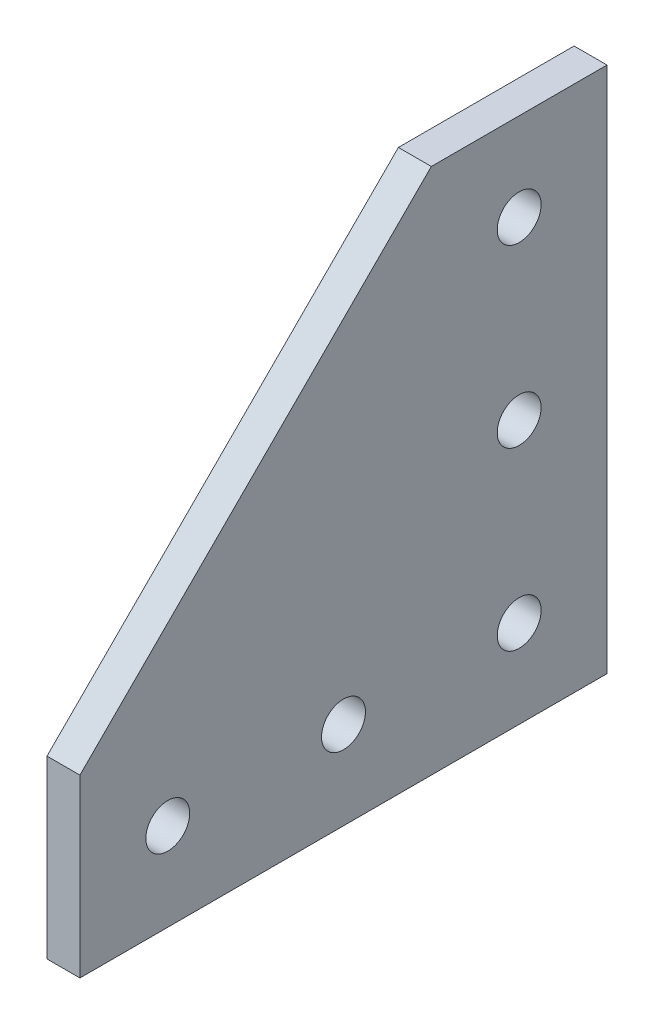
ISO-10303-21;
HEADER;
FILE_DESCRIPTION(('STEP AP214'),'2;1');
FILE_NAME('part.step','',(''),(''),'','','');
FILE_SCHEMA(('AUTOMOTIVE_DESIGN { 1 0 10303 214 1 1 1 1 }'));
ENDSEC;
DATA;
#1=APPLICATION_CONTEXT('core data for automotive mechanical design processes');
#2=APPLICATION_PROTOCOL_DEFINITION('international standard','automotive_design',2000,#1);
#3=PRODUCT_CONTEXT('',#1,'mechanical');
#4=PRODUCT('Part','Part','',(#3));
#5=PRODUCT_RELATED_PRODUCT_CATEGORY('part','',(#4));
#6=PRODUCT_DEFINITION_FORMATION('','',#4);
#7=PRODUCT_DEFINITION_CONTEXT('part definition',#1,'design');
#8=PRODUCT_DEFINITION('design','',#6,#7);
#9=PRODUCT_DEFINITION_SHAPE('','',#8);
#10=(LENGTH_UNIT() NAMED_UNIT(*) SI_UNIT(.MILLI.,.METRE.));
#11=(NAMED_UNIT(*) PLANE_ANGLE_UNIT() SI_UNIT($,.RADIAN.));
#12=(NAMED_UNIT(*) SI_UNIT($,.STERADIAN.) SOLID_ANGLE_UNIT());
#13=UNCERTAINTY_MEASURE_WITH_UNIT(LENGTH_MEASURE(1.E-05),#10,'distance_accuracy_value','');
#14=(GEOMETRIC_REPRESENTATION_CONTEXT(3) GLOBAL_UNCERTAINTY_ASSIGNED_CONTEXT((#13)) GLOBAL_UNIT_ASSIGNED_CONTEXT((#10,
#11,#12)) REPRESENTATION_CONTEXT('',''));
#15=CARTESIAN_POINT('',(0.,0.,0.));
#16=DIRECTION('',(0.,0.,1.));
#17=DIRECTION('',(1.,0.,0.));
#18=AXIS2_PLACEMENT_3D('',#15,#16,#17);
#19=CARTESIAN_POINT('',(4.7625,0.,0.));
#20=DIRECTION('',(-1.,0.,0.));
#21=DIRECTION('',(0.,0.,1.));
#22=AXIS2_PLACEMENT_3D('',#19,#20,#21);
#23=PLANE('',#22);
#24=DIRECTION('',(0.,1.,0.));
#25=VECTOR('',#24,1.);
#26=CARTESIAN_POINT('',(4.7625,76.2,0.));
#27=LINE('',#26,#25);
#28=CARTESIAN_POINT('',(4.7625,0.,0.));
#29=VERTEX_POINT('',#28);
#30=CARTESIAN_POINT('',(4.7625,76.2,0.));
#31=VERTEX_POINT('',#30);
#32=EDGE_CURVE('E117',#29,#31,#27,.T.);
#33=ORIENTED_EDGE('',*,*,#32,.T.);
#34=DIRECTION('',(0.,0.,1.));
#35=VECTOR('',#34,1.);
#36=CARTESIAN_POINT('',(4.7625,76.2,25.4));
#37=LINE('',#36,#35);
#38=CARTESIAN_POINT('',(4.7625,76.2,25.4));
#39=VERTEX_POINT('',#38);
#40=EDGE_CURVE('E84',#31,#39,#37,.T.);
#41=ORIENTED_EDGE('',*,*,#40,.T.);
#42=DIRECTION('',(0.,-0.707106781186547,0.707106781186547));
#43=VECTOR('',#42,1.);
#44=CARTESIAN_POINT('',(4.7625,25.4,76.2));
#45=LINE('',#44,#43);
#46=CARTESIAN_POINT('',(4.7625,25.4,76.2));
#47=VERTEX_POINT('',#46);
#48=EDGE_CURVE('E88',#39,#47,#45,.T.);
#49=ORIENTED_EDGE('',*,*,#48,.T.);
#50=DIRECTION('',(0.,-1.,0.));
#51=VECTOR('',#50,1.);
#52=CARTESIAN_POINT('',(4.7625,0.,76.2));
#53=LINE('',#52,#51);
#54=CARTESIAN_POINT('',(4.7625,0.,76.2));
#55=VERTEX_POINT('',#54);
#56=EDGE_CURVE('E92',#47,#55,#53,.T.);
#57=ORIENTED_EDGE('',*,*,#56,.T.);
#58=DIRECTION('',(0.,0.,-1.));
#59=VECTOR('',#58,1.);
#60=CARTESIAN_POINT('',(4.7625,0.,0.));
#61=LINE('',#60,#59);
#62=EDGE_CURVE('E50',#55,#29,#61,.T.);
#63=ORIENTED_EDGE('',*,*,#62,.T.);
#64=EDGE_LOOP('',(#33,#41,#49,#57,#63));
#65=FACE_BOUND('',#64,.T.);
#66=CARTESIAN_POINT('',(4.7625,12.7,12.7));
#67=DIRECTION('',(1.,0.,0.));
#68=DIRECTION('',(0.,0.,-1.));
#69=AXIS2_PLACEMENT_3D('',#66,#67,#68);
#70=CIRCLE('',#69,3.175);
#71=CARTESIAN_POINT('',(4.7625,12.7,9.52500000000001));
#72=VERTEX_POINT('',#71);
#73=EDGE_CURVE('E112',#72,#72,#70,.T.);
#74=ORIENTED_EDGE('',*,*,#73,.F.);
#75=EDGE_LOOP('',(#74));
#76=FACE_BOUND('',#75,.T.);
#77=CARTESIAN_POINT('',(4.7625,38.1,12.7));
#78=DIRECTION('',(1.,0.,0.));
#79=DIRECTION('',(0.,0.,-1.));
#80=AXIS2_PLACEMENT_3D('',#77,#78,#79);
#81=CIRCLE('',#80,3.175);
#82=CARTESIAN_POINT('',(4.7625,38.1,9.525));
#83=VERTEX_POINT('',#82);
#84=EDGE_CURVE('E186',#83,#83,#81,.T.);
#85=ORIENTED_EDGE('',*,*,#84,.F.);
#86=EDGE_LOOP('',(#85));
#87=FACE_BOUND('',#86,.T.);
#88=CARTESIAN_POINT('',(4.7625,63.5,12.7));
#89=DIRECTION('',(1.,0.,0.));
#90=DIRECTION('',(0.,0.,-1.));
#91=AXIS2_PLACEMENT_3D('',#88,#89,#90);
#92=CIRCLE('',#91,3.175);
#93=CARTESIAN_POINT('',(4.7625,63.5,9.525));
#94=VERTEX_POINT('',#93);
#95=EDGE_CURVE('E180',#94,#94,#92,.T.);
#96=ORIENTED_EDGE('',*,*,#95,.F.);
#97=EDGE_LOOP('',(#96));
#98=FACE_BOUND('',#97,.T.);
#99=CARTESIAN_POINT('',(4.7625,12.7,38.1));
#100=DIRECTION('',(1.,0.,0.));
#101=DIRECTION('',(0.,0.,-1.));
#102=AXIS2_PLACEMENT_3D('',#99,#100,#101);
#103=CIRCLE('',#102,3.175);
#104=CARTESIAN_POINT('',(4.7625,12.7,34.925));
#105=VERTEX_POINT('',#104);
#106=EDGE_CURVE('E174',#105,#105,#103,.T.);
#107=ORIENTED_EDGE('',*,*,#106,.F.);
#108=EDGE_LOOP('',(#107));
#109=FACE_BOUND('',#108,.T.);
#110=CARTESIAN_POINT('',(4.7625,12.7,63.5));
#111=DIRECTION('',(1.,0.,0.));
#112=DIRECTION('',(0.,0.,-1.));
#113=AXIS2_PLACEMENT_3D('',#110,#111,#112);
#114=CIRCLE('',#113,3.175);
#115=CARTESIAN_POINT('',(4.7625,12.7,60.325));
#116=VERTEX_POINT('',#115);
#117=EDGE_CURVE('E165',#116,#116,#114,.T.);
#118=ORIENTED_EDGE('',*,*,#117,.F.);
#119=EDGE_LOOP('',(#118));
#120=FACE_BOUND('',#119,.T.);
#121=ADVANCED_FACE('F33',(#65,#76,#87,#98,#109,#120),#23,.F.);
#122=CARTESIAN_POINT('',(0.,0.,0.));
#123=DIRECTION('',(-1.,0.,0.));
#124=DIRECTION('',(0.,0.,1.));
#125=AXIS2_PLACEMENT_3D('',#122,#123,#124);
#126=PLANE('',#125);
#127=CARTESIAN_POINT('',(0.,12.7,38.1));
#128=DIRECTION('',(1.,0.,0.));
#129=DIRECTION('',(0.,0.,-1.));
#130=AXIS2_PLACEMENT_3D('',#127,#128,#129);
#131=CIRCLE('',#130,3.175);
#132=CARTESIAN_POINT('',(0.,12.7,34.925));
#133=VERTEX_POINT('',#132);
#134=EDGE_CURVE('E171',#133,#133,#131,.T.);
#135=ORIENTED_EDGE('',*,*,#134,.T.);
#136=EDGE_LOOP('',(#135));
#137=FACE_BOUND('',#136,.T.);
#138=CARTESIAN_POINT('',(0.,38.1,12.7));
#139=DIRECTION('',(1.,0.,0.));
#140=DIRECTION('',(0.,0.,-1.));
#141=AXIS2_PLACEMENT_3D('',#138,#139,#140);
#142=CIRCLE('',#141,3.175);
#143=CARTESIAN_POINT('',(0.,38.1,9.525));
#144=VERTEX_POINT('',#143);
#145=EDGE_CURVE('E183',#144,#144,#142,.T.);
#146=ORIENTED_EDGE('',*,*,#145,.T.);
#147=EDGE_LOOP('',(#146));
#148=FACE_BOUND('',#147,.T.);
#149=DIRECTION('',(0.,1.,0.));
#150=VECTOR('',#149,1.);
#151=CARTESIAN_POINT('',(0.,76.2,0.));
#152=LINE('',#151,#150);
#153=CARTESIAN_POINT('',(0.,0.,0.));
#154=VERTEX_POINT('',#153);
#155=CARTESIAN_POINT('',(0.,76.2,0.));
#156=VERTEX_POINT('',#155);
#157=EDGE_CURVE('E108',#154,#156,#152,.T.);
#158=ORIENTED_EDGE('',*,*,#157,.F.);
#159=DIRECTION('',(0.,0.,-1.));
#160=VECTOR('',#159,1.);
#161=CARTESIAN_POINT('',(0.,0.,0.));
#162=LINE('',#161,#160);
#163=CARTESIAN_POINT('',(0.,0.,76.2));
#164=VERTEX_POINT('',#163);
#165=EDGE_CURVE('E76',#164,#154,#162,.T.);
#166=ORIENTED_EDGE('',*,*,#165,.F.);
#167=DIRECTION('',(0.,-1.,0.));
#168=VECTOR('',#167,1.);
#169=CARTESIAN_POINT('',(0.,0.,76.2));
#170=LINE('',#169,#168);
#171=CARTESIAN_POINT('',(0.,25.4,76.2));
#172=VERTEX_POINT('',#171);
#173=EDGE_CURVE('E70',#172,#164,#170,.T.);
#174=ORIENTED_EDGE('',*,*,#173,.F.);
#175=DIRECTION('',(0.,-0.707106781186547,0.707106781186547));
#176=VECTOR('',#175,1.);
#177=CARTESIAN_POINT('',(0.,25.4,76.2));
#178=LINE('',#177,#176);
#179=CARTESIAN_POINT('',(0.,76.2,25.4));
#180=VERTEX_POINT('',#179);
#181=EDGE_CURVE('E99',#180,#172,#178,.T.);
#182=ORIENTED_EDGE('',*,*,#181,.F.);
#183=DIRECTION('',(0.,0.,1.));
#184=VECTOR('',#183,1.);
#185=CARTESIAN_POINT('',(0.,76.2,25.4));
#186=LINE('',#185,#184);
#187=EDGE_CURVE('E111',#156,#180,#186,.T.);
#188=ORIENTED_EDGE('',*,*,#187,.F.);
#189=EDGE_LOOP('',(#158,#166,#174,#182,#188));
#190=FACE_BOUND('',#189,.T.);
#191=CARTESIAN_POINT('',(0.,12.7,12.7));
#192=DIRECTION('',(1.,0.,0.));
#193=DIRECTION('',(0.,0.,-1.));
#194=AXIS2_PLACEMENT_3D('',#191,#192,#193);
#195=CIRCLE('',#194,3.175);
#196=CARTESIAN_POINT('',(0.,12.7,9.52500000000001));
#197=VERTEX_POINT('',#196);
#198=EDGE_CURVE('E189',#197,#197,#195,.T.);
#199=ORIENTED_EDGE('',*,*,#198,.T.);
#200=EDGE_LOOP('',(#199));
#201=FACE_BOUND('',#200,.T.);
#202=CARTESIAN_POINT('',(0.,63.5,12.7));
#203=DIRECTION('',(1.,0.,0.));
#204=DIRECTION('',(0.,0.,-1.));
#205=AXIS2_PLACEMENT_3D('',#202,#203,#204);
#206=CIRCLE('',#205,3.175);
#207=CARTESIAN_POINT('',(0.,63.5,9.525));
#208=VERTEX_POINT('',#207);
#209=EDGE_CURVE('E177',#208,#208,#206,.T.);
#210=ORIENTED_EDGE('',*,*,#209,.T.);
#211=EDGE_LOOP('',(#210));
#212=FACE_BOUND('',#211,.T.);
#213=CARTESIAN_POINT('',(0.,12.7,63.5));
#214=DIRECTION('',(1.,0.,0.));
#215=DIRECTION('',(0.,0.,-1.));
#216=AXIS2_PLACEMENT_3D('',#213,#214,#215);
#217=CIRCLE('',#216,3.175);
#218=CARTESIAN_POINT('',(0.,12.7,60.325));
#219=VERTEX_POINT('',#218);
#220=EDGE_CURVE('E168',#219,#219,#217,.T.);
#221=ORIENTED_EDGE('',*,*,#220,.T.);
#222=EDGE_LOOP('',(#221));
#223=FACE_BOUND('',#222,.T.);
#224=ADVANCED_FACE('F121',(#137,#148,#190,#201,#212,#223),#126,.T.);
#225=CARTESIAN_POINT('',(4.7625,76.2,0.));
#226=DIRECTION('',(0.,0.,1.));
#227=DIRECTION('',(0.,-1.,0.));
#228=AXIS2_PLACEMENT_3D('',#225,#226,#227);
#229=PLANE('',#228);
#230=ORIENTED_EDGE('',*,*,#157,.T.);
#231=DIRECTION('',(-1.,0.,0.));
#232=VECTOR('',#231,1.);
#233=CARTESIAN_POINT('',(4.7625,76.2,0.));
#234=LINE('',#233,#232);
#235=EDGE_CURVE('E11',#31,#156,#234,.T.);
#236=ORIENTED_EDGE('',*,*,#235,.F.);
#237=ORIENTED_EDGE('',*,*,#32,.F.);
#238=DIRECTION('',(-1.,0.,0.));
#239=VECTOR('',#238,1.);
#240=CARTESIAN_POINT('',(4.7625,0.,0.));
#241=LINE('',#240,#239);
#242=EDGE_CURVE('E104',#29,#154,#241,.T.);
#243=ORIENTED_EDGE('',*,*,#242,.T.);
#244=EDGE_LOOP('',(#230,#236,#237,#243));
#245=FACE_BOUND('',#244,.T.);
#246=ADVANCED_FACE('F35',(#245),#229,.F.);
#247=CARTESIAN_POINT('',(4.7625,76.2,25.4));
#248=DIRECTION('',(0.,-1.,0.));
#249=DIRECTION('',(0.,0.,-1.));
#250=AXIS2_PLACEMENT_3D('',#247,#248,#249);
#251=PLANE('',#250);
#252=ORIENTED_EDGE('',*,*,#187,.T.);
#253=DIRECTION('',(-1.,0.,0.));
#254=VECTOR('',#253,1.);
#255=CARTESIAN_POINT('',(4.7625,76.2,25.4));
#256=LINE('',#255,#254);
#257=EDGE_CURVE('E42',#39,#180,#256,.T.);
#258=ORIENTED_EDGE('',*,*,#257,.F.);
#259=ORIENTED_EDGE('',*,*,#40,.F.);
#260=ORIENTED_EDGE('',*,*,#235,.T.);
#261=EDGE_LOOP('',(#252,#258,#259,#260));
#262=FACE_BOUND('',#261,.T.);
#263=ADVANCED_FACE('F249',(#262),#251,.F.);
#264=CARTESIAN_POINT('',(4.7625,25.4,76.2));
#265=DIRECTION('',(0.,-0.707106781186547,-0.707106781186547));
#266=DIRECTION('',(0.,0.707106781186548,-0.707106781186548));
#267=AXIS2_PLACEMENT_3D('',#264,#265,#266);
#268=PLANE('',#267);
#269=ORIENTED_EDGE('',*,*,#181,.T.);
#270=DIRECTION('',(-1.,0.,0.));
#271=VECTOR('',#270,1.);
#272=CARTESIAN_POINT('',(4.7625,25.4,76.2));
#273=LINE('',#272,#271);
#274=EDGE_CURVE('E96',#47,#172,#273,.T.);
#275=ORIENTED_EDGE('',*,*,#274,.F.);
#276=ORIENTED_EDGE('',*,*,#48,.F.);
#277=ORIENTED_EDGE('',*,*,#257,.T.);
#278=EDGE_LOOP('',(#269,#275,#276,#277));
#279=FACE_BOUND('',#278,.T.);
#280=ADVANCED_FACE('F97',(#279),#268,.F.);
#281=CARTESIAN_POINT('',(4.7625,0.,76.2));
#282=DIRECTION('',(0.,0.,-1.));
#283=DIRECTION('',(-1.,0.,0.));
#284=AXIS2_PLACEMENT_3D('',#281,#282,#283);
#285=PLANE('',#284);
#286=ORIENTED_EDGE('',*,*,#173,.T.);
#287=DIRECTION('',(-1.,0.,0.));
#288=VECTOR('',#287,1.);
#289=CARTESIAN_POINT('',(4.7625,0.,76.2));
#290=LINE('',#289,#288);
#291=EDGE_CURVE('E100',#55,#164,#290,.T.);
#292=ORIENTED_EDGE('',*,*,#291,.F.);
#293=ORIENTED_EDGE('',*,*,#56,.F.);
#294=ORIENTED_EDGE('',*,*,#274,.T.);
#295=EDGE_LOOP('',(#286,#292,#293,#294));
#296=FACE_BOUND('',#295,.T.);
#297=ADVANCED_FACE('F102',(#296),#285,.F.);
#298=CARTESIAN_POINT('',(4.7625,0.,0.));
#299=DIRECTION('',(0.,1.,0.));
#300=DIRECTION('',(0.,0.,1.));
#301=AXIS2_PLACEMENT_3D('',#298,#299,#300);
#302=PLANE('',#301);
#303=ORIENTED_EDGE('',*,*,#165,.T.);
#304=ORIENTED_EDGE('',*,*,#242,.F.);
#305=ORIENTED_EDGE('',*,*,#62,.F.);
#306=ORIENTED_EDGE('',*,*,#291,.T.);
#307=EDGE_LOOP('',(#303,#304,#305,#306));
#308=FACE_BOUND('',#307,.T.);
#309=ADVANCED_FACE('F126',(#308),#302,.F.);
#310=CARTESIAN_POINT('',(4.7625,12.7,12.7));
#311=DIRECTION('',(-1.,0.,0.));
#312=DIRECTION('',(0.,0.,1.));
#313=AXIS2_PLACEMENT_3D('',#310,#311,#312);
#314=CYLINDRICAL_SURFACE('',#313,3.175);
#315=ORIENTED_EDGE('',*,*,#73,.T.);
#316=EDGE_LOOP('',(#315));
#317=FACE_BOUND('',#316,.T.);
#318=ORIENTED_EDGE('',*,*,#198,.F.);
#319=EDGE_LOOP('',(#318));
#320=FACE_BOUND('',#319,.T.);
#321=ADVANCED_FACE('F128',(#317,#320),#314,.F.);
#322=CARTESIAN_POINT('',(4.7625,38.1,12.7));
#323=DIRECTION('',(-1.,0.,0.));
#324=DIRECTION('',(0.,0.,1.));
#325=AXIS2_PLACEMENT_3D('',#322,#323,#324);
#326=CYLINDRICAL_SURFACE('',#325,3.175);
#327=ORIENTED_EDGE('',*,*,#84,.T.);
#328=EDGE_LOOP('',(#327));
#329=FACE_BOUND('',#328,.T.);
#330=ORIENTED_EDGE('',*,*,#145,.F.);
#331=EDGE_LOOP('',(#330));
#332=FACE_BOUND('',#331,.T.);
#333=ADVANCED_FACE('F134',(#329,#332),#326,.F.);
#334=CARTESIAN_POINT('',(4.7625,63.5,12.7));
#335=DIRECTION('',(-1.,0.,0.));
#336=DIRECTION('',(0.,0.,1.));
#337=AXIS2_PLACEMENT_3D('',#334,#335,#336);
#338=CYLINDRICAL_SURFACE('',#337,3.175);
#339=ORIENTED_EDGE('',*,*,#95,.T.);
#340=EDGE_LOOP('',(#339));
#341=FACE_BOUND('',#340,.T.);
#342=ORIENTED_EDGE('',*,*,#209,.F.);
#343=EDGE_LOOP('',(#342));
#344=FACE_BOUND('',#343,.T.);
#345=ADVANCED_FACE('F148',(#341,#344),#338,.F.);
#346=CARTESIAN_POINT('',(4.7625,12.7,38.1));
#347=DIRECTION('',(-1.,0.,0.));
#348=DIRECTION('',(0.,0.,1.));
#349=AXIS2_PLACEMENT_3D('',#346,#347,#348);
#350=CYLINDRICAL_SURFACE('',#349,3.175);
#351=ORIENTED_EDGE('',*,*,#106,.T.);
#352=EDGE_LOOP('',(#351));
#353=FACE_BOUND('',#352,.T.);
#354=ORIENTED_EDGE('',*,*,#134,.F.);
#355=EDGE_LOOP('',(#354));
#356=FACE_BOUND('',#355,.T.);
#357=ADVANCED_FACE('F152',(#353,#356),#350,.F.);
#358=CARTESIAN_POINT('',(4.7625,12.7,63.5));
#359=DIRECTION('',(-1.,0.,0.));
#360=DIRECTION('',(0.,0.,1.));
#361=AXIS2_PLACEMENT_3D('',#358,#359,#360);
#362=CYLINDRICAL_SURFACE('',#361,3.175);
#363=ORIENTED_EDGE('',*,*,#117,.T.);
#364=EDGE_LOOP('',(#363));
#365=FACE_BOUND('',#364,.T.);
#366=ORIENTED_EDGE('',*,*,#220,.F.);
#367=EDGE_LOOP('',(#366));
#368=FACE_BOUND('',#367,.T.);
#369=ADVANCED_FACE('F156',(#365,#368),#362,.F.);
#370=CLOSED_SHELL('',(#121,#224,#246,#263,#280,#297,#309,#321,#333,#345,#357,#369));
#371=MANIFOLD_SOLID_BREP('B2',#370);
#372=ADVANCED_BREP_SHAPE_REPRESENTATION('',(#18,#371),#14);
#373=SHAPE_DEFINITION_REPRESENTATION(#9,#372);
ENDSEC;
END-ISO-10303-21;
